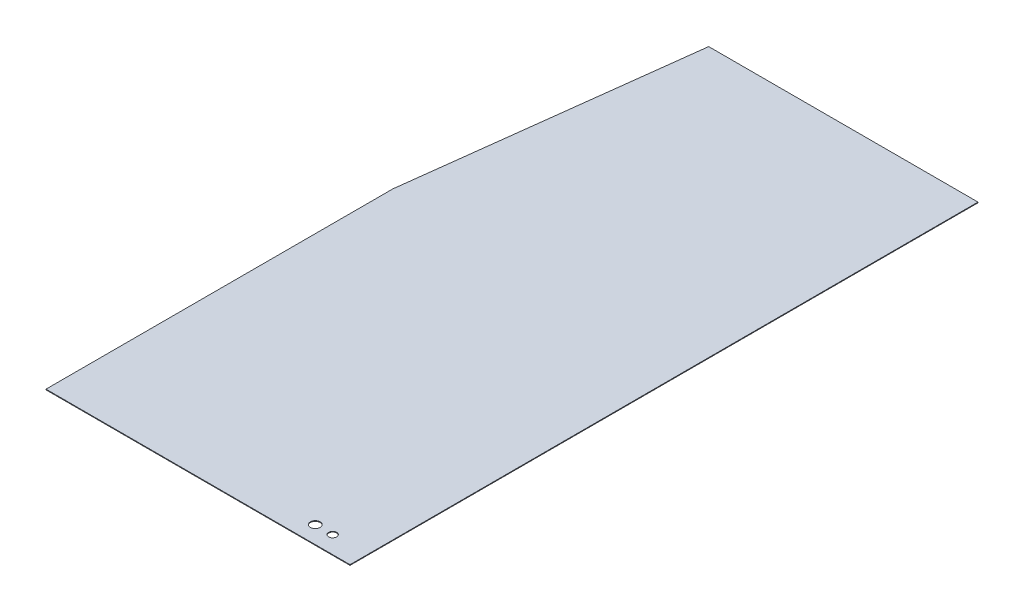
ISO-10303-21;
HEADER;
FILE_DESCRIPTION(('STEP AP214'),'2;1');
FILE_NAME('part.step','',(''),(''),'','','');
FILE_SCHEMA(('AUTOMOTIVE_DESIGN { 1 0 10303 214 1 1 1 1 }'));
ENDSEC;
DATA;
#1=APPLICATION_CONTEXT('core data for automotive mechanical design processes');
#2=APPLICATION_PROTOCOL_DEFINITION('international standard','automotive_design',2000,#1);
#3=PRODUCT_CONTEXT('',#1,'mechanical');
#4=PRODUCT('Part','Part','',(#3));
#5=PRODUCT_RELATED_PRODUCT_CATEGORY('part','',(#4));
#6=PRODUCT_DEFINITION_FORMATION('','',#4);
#7=PRODUCT_DEFINITION_CONTEXT('part definition',#1,'design');
#8=PRODUCT_DEFINITION('design','',#6,#7);
#9=PRODUCT_DEFINITION_SHAPE('','',#8);
#10=(LENGTH_UNIT() NAMED_UNIT(*) SI_UNIT(.MILLI.,.METRE.));
#11=(NAMED_UNIT(*) PLANE_ANGLE_UNIT() SI_UNIT($,.RADIAN.));
#12=(NAMED_UNIT(*) SI_UNIT($,.STERADIAN.) SOLID_ANGLE_UNIT());
#13=UNCERTAINTY_MEASURE_WITH_UNIT(LENGTH_MEASURE(1.E-05),#10,'distance_accuracy_value','');
#14=(GEOMETRIC_REPRESENTATION_CONTEXT(3) GLOBAL_UNCERTAINTY_ASSIGNED_CONTEXT((#13)) GLOBAL_UNIT_ASSIGNED_CONTEXT((#10,
#11,#12)) REPRESENTATION_CONTEXT('',''));
#15=CARTESIAN_POINT('',(0.,0.,0.));
#16=DIRECTION('',(0.,0.,1.));
#17=DIRECTION('',(1.,0.,0.));
#18=AXIS2_PLACEMENT_3D('',#15,#16,#17);
#19=CARTESIAN_POINT('',(438.1,1.9,-1810.));
#20=DIRECTION('',(-1.,0.,0.));
#21=DIRECTION('',(0.,0.,1.));
#22=AXIS2_PLACEMENT_3D('',#19,#20,#21);
#23=PLANE('',#22);
#24=DIRECTION('',(0.,0.,-1.));
#25=VECTOR('',#24,1.);
#26=CARTESIAN_POINT('',(438.1,0.,-1810.));
#27=LINE('',#26,#25);
#28=CARTESIAN_POINT('',(438.1,0.,1.07536235433129E-13));
#29=VERTEX_POINT('',#28);
#30=CARTESIAN_POINT('',(438.1,0.,-1810.));
#31=VERTEX_POINT('',#30);
#32=EDGE_CURVE('E122',#29,#31,#27,.T.);
#33=ORIENTED_EDGE('',*,*,#32,.T.);
#34=DIRECTION('',(0.,-1.,0.));
#35=VECTOR('',#34,1.);
#36=CARTESIAN_POINT('',(438.1,1.9,-1810.));
#37=LINE('',#36,#35);
#38=CARTESIAN_POINT('',(438.1,1.9,-1810.));
#39=VERTEX_POINT('',#38);
#40=EDGE_CURVE('E11',#39,#31,#37,.T.);
#41=ORIENTED_EDGE('',*,*,#40,.F.);
#42=DIRECTION('',(0.,0.,-1.));
#43=VECTOR('',#42,1.);
#44=CARTESIAN_POINT('',(438.1,1.9,-1810.));
#45=LINE('',#44,#43);
#46=CARTESIAN_POINT('',(438.1,1.9,1.07536235433129E-13));
#47=VERTEX_POINT('',#46);
#48=EDGE_CURVE('E136',#47,#39,#45,.T.);
#49=ORIENTED_EDGE('',*,*,#48,.F.);
#50=DIRECTION('',(0.,-1.,0.));
#51=VECTOR('',#50,1.);
#52=CARTESIAN_POINT('',(438.1,1.9,1.07536235433129E-13));
#53=LINE('',#52,#51);
#54=EDGE_CURVE('E118',#47,#29,#53,.T.);
#55=ORIENTED_EDGE('',*,*,#54,.T.);
#56=EDGE_LOOP('',(#33,#41,#49,#55));
#57=FACE_BOUND('',#56,.T.);
#58=ADVANCED_FACE('F43',(#57),#23,.F.);
#59=CARTESIAN_POINT('',(-338.1,1.9,-1810.));
#60=DIRECTION('',(0.,0.,1.));
#61=DIRECTION('',(1.,0.,0.));
#62=AXIS2_PLACEMENT_3D('',#59,#60,#61);
#63=PLANE('',#62);
#64=DIRECTION('',(-1.,0.,0.));
#65=VECTOR('',#64,1.);
#66=CARTESIAN_POINT('',(-338.1,0.,-1810.));
#67=LINE('',#66,#65);
#68=CARTESIAN_POINT('',(-338.1,0.,-1810.));
#69=VERTEX_POINT('',#68);
#70=EDGE_CURVE('E126',#31,#69,#67,.T.);
#71=ORIENTED_EDGE('',*,*,#70,.T.);
#72=DIRECTION('',(0.,-1.,0.));
#73=VECTOR('',#72,1.);
#74=CARTESIAN_POINT('',(-338.1,1.9,-1810.));
#75=LINE('',#74,#73);
#76=CARTESIAN_POINT('',(-338.1,1.9,-1810.));
#77=VERTEX_POINT('',#76);
#78=EDGE_CURVE('E52',#77,#69,#75,.T.);
#79=ORIENTED_EDGE('',*,*,#78,.F.);
#80=DIRECTION('',(-1.,0.,0.));
#81=VECTOR('',#80,1.);
#82=CARTESIAN_POINT('',(-338.1,1.9,-1810.));
#83=LINE('',#82,#81);
#84=EDGE_CURVE('E94',#39,#77,#83,.T.);
#85=ORIENTED_EDGE('',*,*,#84,.F.);
#86=ORIENTED_EDGE('',*,*,#40,.T.);
#87=EDGE_LOOP('',(#71,#79,#85,#86));
#88=FACE_BOUND('',#87,.T.);
#89=ADVANCED_FACE('F159',(#88),#63,.F.);
#90=CARTESIAN_POINT('',(-438.1,1.9,-1000.));
#91=DIRECTION('',(0.992465233221436,0.,0.122526572002646));
#92=DIRECTION('',(0.122526572002646,0.,-0.992465233221437));
#93=AXIS2_PLACEMENT_3D('',#90,#91,#92);
#94=PLANE('',#93);
#95=DIRECTION('',(-0.122526572002646,0.,0.992465233221436));
#96=VECTOR('',#95,1.);
#97=CARTESIAN_POINT('',(-438.1,0.,-1000.));
#98=LINE('',#97,#96);
#99=CARTESIAN_POINT('',(-438.1,0.,-1000.));
#100=VERTEX_POINT('',#99);
#101=EDGE_CURVE('E110',#69,#100,#98,.T.);
#102=ORIENTED_EDGE('',*,*,#101,.T.);
#103=DIRECTION('',(0.,-1.,0.));
#104=VECTOR('',#103,1.);
#105=CARTESIAN_POINT('',(-438.1,1.9,-1000.));
#106=LINE('',#105,#104);
#107=CARTESIAN_POINT('',(-438.1,1.9,-1000.));
#108=VERTEX_POINT('',#107);
#109=EDGE_CURVE('E107',#108,#100,#106,.T.);
#110=ORIENTED_EDGE('',*,*,#109,.F.);
#111=DIRECTION('',(-0.122526572002646,0.,0.992465233221436));
#112=VECTOR('',#111,1.);
#113=CARTESIAN_POINT('',(-438.1,1.9,-1000.));
#114=LINE('',#113,#112);
#115=EDGE_CURVE('E98',#77,#108,#114,.T.);
#116=ORIENTED_EDGE('',*,*,#115,.F.);
#117=ORIENTED_EDGE('',*,*,#78,.T.);
#118=EDGE_LOOP('',(#102,#110,#116,#117));
#119=FACE_BOUND('',#118,.T.);
#120=ADVANCED_FACE('F108',(#119),#94,.F.);
#121=CARTESIAN_POINT('',(-438.1,1.9,1.07536235433129E-13));
#122=DIRECTION('',(1.,0.,0.));
#123=DIRECTION('',(0.,0.,-1.));
#124=AXIS2_PLACEMENT_3D('',#121,#122,#123);
#125=PLANE('',#124);
#126=DIRECTION('',(0.,0.,1.));
#127=VECTOR('',#126,1.);
#128=CARTESIAN_POINT('',(-438.1,0.,1.07536235433129E-13));
#129=LINE('',#128,#127);
#130=CARTESIAN_POINT('',(-438.1,0.,1.07536235433129E-13));
#131=VERTEX_POINT('',#130);
#132=EDGE_CURVE('E80',#100,#131,#129,.T.);
#133=ORIENTED_EDGE('',*,*,#132,.T.);
#134=DIRECTION('',(0.,-1.,0.));
#135=VECTOR('',#134,1.);
#136=CARTESIAN_POINT('',(-438.1,1.9,1.07536235433129E-13));
#137=LINE('',#136,#135);
#138=CARTESIAN_POINT('',(-438.1,1.9,1.07536235433129E-13));
#139=VERTEX_POINT('',#138);
#140=EDGE_CURVE('E112',#139,#131,#137,.T.);
#141=ORIENTED_EDGE('',*,*,#140,.F.);
#142=DIRECTION('',(0.,0.,1.));
#143=VECTOR('',#142,1.);
#144=CARTESIAN_POINT('',(-438.1,1.9,1.07536235433129E-13));
#145=LINE('',#144,#143);
#146=EDGE_CURVE('E102',#108,#139,#145,.T.);
#147=ORIENTED_EDGE('',*,*,#146,.F.);
#148=ORIENTED_EDGE('',*,*,#109,.T.);
#149=EDGE_LOOP('',(#133,#141,#147,#148));
#150=FACE_BOUND('',#149,.T.);
#151=ADVANCED_FACE('F114',(#150),#125,.F.);
#152=CARTESIAN_POINT('',(438.1,1.9,1.07536235433129E-13));
#153=DIRECTION('',(0.,0.,-1.));
#154=DIRECTION('',(-1.,0.,0.));
#155=AXIS2_PLACEMENT_3D('',#152,#153,#154);
#156=PLANE('',#155);
#157=DIRECTION('',(1.,0.,0.));
#158=VECTOR('',#157,1.);
#159=CARTESIAN_POINT('',(438.1,0.,1.07536235433129E-13));
#160=LINE('',#159,#158);
#161=EDGE_CURVE('E86',#131,#29,#160,.T.);
#162=ORIENTED_EDGE('',*,*,#161,.T.);
#163=ORIENTED_EDGE('',*,*,#54,.F.);
#164=DIRECTION('',(1.,0.,0.));
#165=VECTOR('',#164,1.);
#166=CARTESIAN_POINT('',(438.1,1.9,1.07536235433129E-13));
#167=LINE('',#166,#165);
#168=EDGE_CURVE('E60',#139,#47,#167,.T.);
#169=ORIENTED_EDGE('',*,*,#168,.F.);
#170=ORIENTED_EDGE('',*,*,#140,.T.);
#171=EDGE_LOOP('',(#162,#163,#169,#170));
#172=FACE_BOUND('',#171,.T.);
#173=ADVANCED_FACE('F147',(#172),#156,.F.);
#174=CARTESIAN_POINT('',(0.,1.9,0.));
#175=DIRECTION('',(0.,-1.,0.));
#176=DIRECTION('',(0.,0.,-1.));
#177=AXIS2_PLACEMENT_3D('',#174,#175,#176);
#178=PLANE('',#177);
#179=CARTESIAN_POINT('',(338.1,1.9,-49.9999999999999));
#180=DIRECTION('',(0.,1.,0.));
#181=DIRECTION('',(0.,0.,1.));
#182=AXIS2_PLACEMENT_3D('',#179,#180,#181);
#183=CIRCLE('',#182,11.5);
#184=CARTESIAN_POINT('',(338.1,1.9,-38.4999999999999));
#185=VERTEX_POINT('',#184);
#186=EDGE_CURVE('E248',#185,#185,#183,.T.);
#187=ORIENTED_EDGE('',*,*,#186,.F.);
#188=EDGE_LOOP('',(#187));
#189=FACE_BOUND('',#188,.T.);
#190=CARTESIAN_POINT('',(288.1,1.9,-49.9999999999999));
#191=DIRECTION('',(0.,1.,0.));
#192=DIRECTION('',(0.,0.,1.));
#193=AXIS2_PLACEMENT_3D('',#190,#191,#192);
#194=CIRCLE('',#193,14.);
#195=CARTESIAN_POINT('',(288.1,1.9,-35.9999999999999));
#196=VERTEX_POINT('',#195);
#197=EDGE_CURVE('E250',#196,#196,#194,.T.);
#198=ORIENTED_EDGE('',*,*,#197,.F.);
#199=EDGE_LOOP('',(#198));
#200=FACE_BOUND('',#199,.T.);
#201=ORIENTED_EDGE('',*,*,#48,.T.);
#202=ORIENTED_EDGE('',*,*,#84,.T.);
#203=ORIENTED_EDGE('',*,*,#115,.T.);
#204=ORIENTED_EDGE('',*,*,#146,.T.);
#205=ORIENTED_EDGE('',*,*,#168,.T.);
#206=EDGE_LOOP('',(#201,#202,#203,#204,#205));
#207=FACE_BOUND('',#206,.T.);
#208=ADVANCED_FACE('F100',(#189,#200,#207),#178,.F.);
#209=CARTESIAN_POINT('',(0.,0.,0.));
#210=DIRECTION('',(0.,-1.,0.));
#211=DIRECTION('',(0.,0.,-1.));
#212=AXIS2_PLACEMENT_3D('',#209,#210,#211);
#213=PLANE('',#212);
#214=CARTESIAN_POINT('',(338.1,0.,-49.9999999999999));
#215=DIRECTION('',(0.,1.,0.));
#216=DIRECTION('',(0.,0.,1.));
#217=AXIS2_PLACEMENT_3D('',#214,#215,#216);
#218=CIRCLE('',#217,11.5);
#219=CARTESIAN_POINT('',(338.1,0.,-38.4999999999999));
#220=VERTEX_POINT('',#219);
#221=EDGE_CURVE('E127',#220,#220,#218,.T.);
#222=ORIENTED_EDGE('',*,*,#221,.T.);
#223=EDGE_LOOP('',(#222));
#224=FACE_BOUND('',#223,.T.);
#225=CARTESIAN_POINT('',(288.1,0.,-49.9999999999999));
#226=DIRECTION('',(0.,1.,0.));
#227=DIRECTION('',(0.,0.,1.));
#228=AXIS2_PLACEMENT_3D('',#225,#226,#227);
#229=CIRCLE('',#228,14.);
#230=CARTESIAN_POINT('',(288.1,0.,-35.9999999999999));
#231=VERTEX_POINT('',#230);
#232=EDGE_CURVE('E256',#231,#231,#229,.T.);
#233=ORIENTED_EDGE('',*,*,#232,.T.);
#234=EDGE_LOOP('',(#233));
#235=FACE_BOUND('',#234,.T.);
#236=ORIENTED_EDGE('',*,*,#32,.F.);
#237=ORIENTED_EDGE('',*,*,#161,.F.);
#238=ORIENTED_EDGE('',*,*,#132,.F.);
#239=ORIENTED_EDGE('',*,*,#101,.F.);
#240=ORIENTED_EDGE('',*,*,#70,.F.);
#241=EDGE_LOOP('',(#236,#237,#238,#239,#240));
#242=FACE_BOUND('',#241,.T.);
#243=ADVANCED_FACE('F143',(#224,#235,#242),#213,.T.);
#244=CARTESIAN_POINT('',(288.1,0.,-49.9999999999999));
#245=DIRECTION('',(0.,1.,0.));
#246=DIRECTION('',(0.,0.,1.));
#247=AXIS2_PLACEMENT_3D('',#244,#245,#246);
#248=CYLINDRICAL_SURFACE('',#247,14.);
#249=ORIENTED_EDGE('',*,*,#232,.F.);
#250=EDGE_LOOP('',(#249));
#251=FACE_BOUND('',#250,.T.);
#252=ORIENTED_EDGE('',*,*,#197,.T.);
#253=EDGE_LOOP('',(#252));
#254=FACE_BOUND('',#253,.T.);
#255=ADVANCED_FACE('F195',(#251,#254),#248,.F.);
#256=CARTESIAN_POINT('',(338.1,0.,-49.9999999999999));
#257=DIRECTION('',(0.,1.,0.));
#258=DIRECTION('',(0.,0.,1.));
#259=AXIS2_PLACEMENT_3D('',#256,#257,#258);
#260=CYLINDRICAL_SURFACE('',#259,11.5);
#261=ORIENTED_EDGE('',*,*,#221,.F.);
#262=EDGE_LOOP('',(#261));
#263=FACE_BOUND('',#262,.T.);
#264=ORIENTED_EDGE('',*,*,#186,.T.);
#265=EDGE_LOOP('',(#264));
#266=FACE_BOUND('',#265,.T.);
#267=ADVANCED_FACE('F205',(#263,#266),#260,.F.);
#268=CLOSED_SHELL('',(#58,#89,#120,#151,#173,#208,#243,#255,#267));
#269=MANIFOLD_SOLID_BREP('B2',#268);
#270=ADVANCED_BREP_SHAPE_REPRESENTATION('',(#18,#269),#14);
#271=SHAPE_DEFINITION_REPRESENTATION(#9,#270);
ENDSEC;
END-ISO-10303-21;
